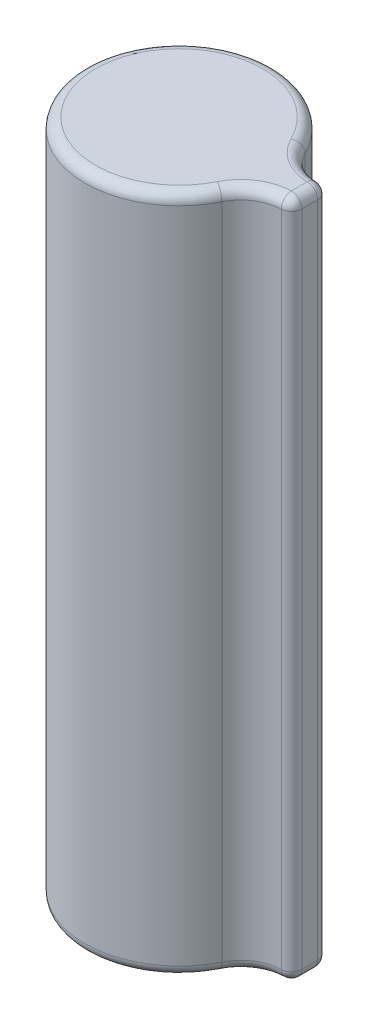
ISO-10303-21;
HEADER;
FILE_DESCRIPTION(('STEP AP214'),'2;1');
FILE_NAME('part.step','',(''),(''),'','','');
FILE_SCHEMA(('AUTOMOTIVE_DESIGN { 1 0 10303 214 1 1 1 1 }'));
ENDSEC;
DATA;
#1=APPLICATION_CONTEXT('core data for automotive mechanical design processes');
#2=APPLICATION_PROTOCOL_DEFINITION('international standard','automotive_design',2000,#1);
#3=PRODUCT_CONTEXT('',#1,'mechanical');
#4=PRODUCT('Part','Part','',(#3));
#5=PRODUCT_RELATED_PRODUCT_CATEGORY('part','',(#4));
#6=PRODUCT_DEFINITION_FORMATION('','',#4);
#7=PRODUCT_DEFINITION_CONTEXT('part definition',#1,'design');
#8=PRODUCT_DEFINITION('design','',#6,#7);
#9=PRODUCT_DEFINITION_SHAPE('','',#8);
#10=(LENGTH_UNIT() NAMED_UNIT(*) SI_UNIT(.MILLI.,.METRE.));
#11=(NAMED_UNIT(*) PLANE_ANGLE_UNIT() SI_UNIT($,.RADIAN.));
#12=(NAMED_UNIT(*) SI_UNIT($,.STERADIAN.) SOLID_ANGLE_UNIT());
#13=UNCERTAINTY_MEASURE_WITH_UNIT(LENGTH_MEASURE(1.E-05),#10,'distance_accuracy_value','');
#14=(GEOMETRIC_REPRESENTATION_CONTEXT(3) GLOBAL_UNCERTAINTY_ASSIGNED_CONTEXT((#13)) GLOBAL_UNIT_ASSIGNED_CONTEXT((#10,
#11,#12)) REPRESENTATION_CONTEXT('',''));
#15=CARTESIAN_POINT('',(0.,0.,0.));
#16=DIRECTION('',(0.,0.,1.));
#17=DIRECTION('',(1.,0.,0.));
#18=AXIS2_PLACEMENT_3D('',#15,#16,#17);
#19=CARTESIAN_POINT('',(0.,65.,0.));
#20=DIRECTION('',(0.,-1.,0.));
#21=DIRECTION('',(0.,0.,-1.));
#22=AXIS2_PLACEMENT_3D('',#19,#20,#21);
#23=CYLINDRICAL_SURFACE('',#22,9.);
#24=DIRECTION('',(0.,-1.,0.));
#25=VECTOR('',#24,1.);
#26=CARTESIAN_POINT('',(8.07177033440378,65.,-3.98076923076923));
#27=LINE('',#26,#25);
#28=CARTESIAN_POINT('',(8.07177033440378,64.,-3.98076923076923));
#29=VERTEX_POINT('',#28);
#30=CARTESIAN_POINT('',(8.07177033440378,1.,-3.98076923076923));
#31=VERTEX_POINT('',#30);
#32=EDGE_CURVE('E144',#29,#31,#27,.T.);
#33=ORIENTED_EDGE('',*,*,#32,.T.);
#34=CARTESIAN_POINT('',(0.,1.,0.));
#35=DIRECTION('',(0.,1.,0.));
#36=DIRECTION('',(0.,0.,1.));
#37=AXIS2_PLACEMENT_3D('',#34,#35,#36);
#38=CIRCLE('',#37,9.);
#39=CARTESIAN_POINT('',(8.07177033440378,1.,3.98076923076923));
#40=VERTEX_POINT('',#39);
#41=EDGE_CURVE('E217',#31,#40,#38,.T.);
#42=ORIENTED_EDGE('',*,*,#41,.T.);
#43=DIRECTION('',(0.,-1.,0.));
#44=VECTOR('',#43,1.);
#45=CARTESIAN_POINT('',(8.07177033440378,65.,3.98076923076923));
#46=LINE('',#45,#44);
#47=CARTESIAN_POINT('',(8.07177033440378,64.,3.98076923076923));
#48=VERTEX_POINT('',#47);
#49=EDGE_CURVE('E182',#40,#48,#46,.F.);
#50=ORIENTED_EDGE('',*,*,#49,.T.);
#51=CARTESIAN_POINT('',(0.,64.,0.));
#52=DIRECTION('',(0.,1.,0.));
#53=DIRECTION('',(0.,0.,1.));
#54=AXIS2_PLACEMENT_3D('',#51,#52,#53);
#55=CIRCLE('',#54,9.);
#56=EDGE_CURVE('E222',#48,#29,#55,.F.);
#57=ORIENTED_EDGE('',*,*,#56,.T.);
#58=EDGE_LOOP('',(#33,#42,#50,#57));
#59=FACE_BOUND('',#58,.T.);
#60=ADVANCED_FACE('F40',(#59),#23,.T.);
#61=CARTESIAN_POINT('',(12.5,65.,0.));
#62=DIRECTION('',(1.,0.,0.));
#63=DIRECTION('',(0.,0.,-1.));
#64=AXIS2_PLACEMENT_3D('',#61,#62,#63);
#65=PLANE('',#64);
#66=DIRECTION('',(0.,1.,0.));
#67=VECTOR('',#66,1.);
#68=CARTESIAN_POINT('',(12.5,0.,0.752535865431005));
#69=LINE('',#68,#67);
#70=CARTESIAN_POINT('',(12.5,64.,0.752535865431005));
#71=VERTEX_POINT('',#70);
#72=CARTESIAN_POINT('',(12.5,1.,0.752535865431005));
#73=VERTEX_POINT('',#72);
#74=EDGE_CURVE('E125',#71,#73,#69,.F.);
#75=ORIENTED_EDGE('',*,*,#74,.T.);
#76=DIRECTION('',(0.,0.,1.));
#77=VECTOR('',#76,1.);
#78=CARTESIAN_POINT('',(12.5,1.,-0.752535865431005));
#79=LINE('',#78,#77);
#80=CARTESIAN_POINT('',(12.5,1.,-0.752535865431005));
#81=VERTEX_POINT('',#80);
#82=EDGE_CURVE('E119',#73,#81,#79,.F.);
#83=ORIENTED_EDGE('',*,*,#82,.T.);
#84=DIRECTION('',(0.,1.,0.));
#85=VECTOR('',#84,1.);
#86=CARTESIAN_POINT('',(12.5,65.,-0.752535865431005));
#87=LINE('',#86,#85);
#88=CARTESIAN_POINT('',(12.5,64.,-0.752535865431005));
#89=VERTEX_POINT('',#88);
#90=EDGE_CURVE('E122',#81,#89,#87,.T.);
#91=ORIENTED_EDGE('',*,*,#90,.T.);
#92=DIRECTION('',(0.,0.,1.));
#93=VECTOR('',#92,1.);
#94=CARTESIAN_POINT('',(12.5,64.,0.));
#95=LINE('',#94,#93);
#96=EDGE_CURVE('E132',#89,#71,#95,.T.);
#97=ORIENTED_EDGE('',*,*,#96,.T.);
#98=EDGE_LOOP('',(#75,#83,#91,#97));
#99=FACE_BOUND('',#98,.T.);
#100=ADVANCED_FACE('F121',(#99),#65,.T.);
#101=CARTESIAN_POINT('',(0.,65.,0.));
#102=DIRECTION('',(0.,1.,0.));
#103=DIRECTION('',(0.,0.,1.));
#104=AXIS2_PLACEMENT_3D('',#101,#102,#103);
#105=PLANE('',#104);
#106=CARTESIAN_POINT('',(11.659223816361,65.,-5.75));
#107=DIRECTION('',(0.,1.,0.));
#108=DIRECTION('',(0.,0.,1.));
#109=AXIS2_PLACEMENT_3D('',#106,#107,#108);
#110=CIRCLE('',#109,5.);
#111=CARTESIAN_POINT('',(11.5,65.,-0.752535865431005));
#112=VERTEX_POINT('',#111);
#113=CARTESIAN_POINT('',(7.17490696391447,65.,-3.53846153846154));
#114=VERTEX_POINT('',#113);
#115=EDGE_CURVE('E50',#112,#114,#110,.F.);
#116=ORIENTED_EDGE('',*,*,#115,.T.);
#117=CARTESIAN_POINT('',(0.,65.,0.));
#118=DIRECTION('',(0.,1.,0.));
#119=DIRECTION('',(0.,0.,1.));
#120=AXIS2_PLACEMENT_3D('',#117,#118,#119);
#121=CIRCLE('',#120,8.);
#122=CARTESIAN_POINT('',(7.17490696391447,65.,3.53846153846154));
#123=VERTEX_POINT('',#122);
#124=EDGE_CURVE('E11',#114,#123,#121,.T.);
#125=ORIENTED_EDGE('',*,*,#124,.T.);
#126=CARTESIAN_POINT('',(11.659223816361,65.,5.75));
#127=DIRECTION('',(0.,1.,0.));
#128=DIRECTION('',(0.,0.,1.));
#129=AXIS2_PLACEMENT_3D('',#126,#127,#128);
#130=CIRCLE('',#129,5.);
#131=CARTESIAN_POINT('',(11.5,65.,0.752535865431005));
#132=VERTEX_POINT('',#131);
#133=EDGE_CURVE('E131',#123,#132,#130,.F.);
#134=ORIENTED_EDGE('',*,*,#133,.T.);
#135=DIRECTION('',(0.,0.,1.));
#136=VECTOR('',#135,1.);
#137=CARTESIAN_POINT('',(11.5,65.,0.));
#138=LINE('',#137,#136);
#139=EDGE_CURVE('E61',#132,#112,#138,.F.);
#140=ORIENTED_EDGE('',*,*,#139,.T.);
#141=EDGE_LOOP('',(#116,#125,#134,#140));
#142=FACE_BOUND('',#141,.T.);
#143=ADVANCED_FACE('F237',(#142),#105,.T.);
#144=CARTESIAN_POINT('',(0.,0.,0.));
#145=DIRECTION('',(0.,1.,0.));
#146=DIRECTION('',(0.,0.,1.));
#147=AXIS2_PLACEMENT_3D('',#144,#145,#146);
#148=PLANE('',#147);
#149=CARTESIAN_POINT('',(0.,0.,0.));
#150=DIRECTION('',(0.,1.,0.));
#151=DIRECTION('',(0.,0.,1.));
#152=AXIS2_PLACEMENT_3D('',#149,#150,#151);
#153=CIRCLE('',#152,8.);
#154=CARTESIAN_POINT('',(7.17490696391447,0.,3.53846153846154));
#155=VERTEX_POINT('',#154);
#156=CARTESIAN_POINT('',(7.17490696391447,0.,-3.53846153846154));
#157=VERTEX_POINT('',#156);
#158=EDGE_CURVE('E263',#155,#157,#153,.F.);
#159=ORIENTED_EDGE('',*,*,#158,.T.);
#160=CARTESIAN_POINT('',(11.659223816361,0.,-5.75));
#161=DIRECTION('',(0.,1.,0.));
#162=DIRECTION('',(0.,0.,1.));
#163=AXIS2_PLACEMENT_3D('',#160,#161,#162);
#164=CIRCLE('',#163,5.);
#165=CARTESIAN_POINT('',(11.5,0.,-0.752535865431005));
#166=VERTEX_POINT('',#165);
#167=EDGE_CURVE('E260',#157,#166,#164,.T.);
#168=ORIENTED_EDGE('',*,*,#167,.T.);
#169=DIRECTION('',(0.,0.,1.));
#170=VECTOR('',#169,1.);
#171=CARTESIAN_POINT('',(11.5,0.,0.752535865431005));
#172=LINE('',#171,#170);
#173=CARTESIAN_POINT('',(11.5,0.,0.752535865431005));
#174=VERTEX_POINT('',#173);
#175=EDGE_CURVE('E153',#166,#174,#172,.T.);
#176=ORIENTED_EDGE('',*,*,#175,.T.);
#177=CARTESIAN_POINT('',(11.659223816361,0.,5.75));
#178=DIRECTION('',(0.,1.,0.));
#179=DIRECTION('',(0.,0.,1.));
#180=AXIS2_PLACEMENT_3D('',#177,#178,#179);
#181=CIRCLE('',#180,5.);
#182=EDGE_CURVE('E266',#174,#155,#181,.T.);
#183=ORIENTED_EDGE('',*,*,#182,.T.);
#184=EDGE_LOOP('',(#159,#168,#176,#183));
#185=FACE_BOUND('',#184,.T.);
#186=ADVANCED_FACE('F300',(#185),#148,.F.);
#187=CARTESIAN_POINT('',(11.659223816361,65.,-5.75));
#188=DIRECTION('',(0.,-1.,0.));
#189=DIRECTION('',(0.,0.,-1.));
#190=AXIS2_PLACEMENT_3D('',#187,#188,#189);
#191=CYLINDRICAL_SURFACE('',#190,4.);
#192=DIRECTION('',(0.,-1.,0.));
#193=VECTOR('',#192,1.);
#194=CARTESIAN_POINT('',(11.5318447632722,65.,-1.7520286923448));
#195=LINE('',#194,#193);
#196=CARTESIAN_POINT('',(11.5318447632722,64.,-1.7520286923448));
#197=VERTEX_POINT('',#196);
#198=CARTESIAN_POINT('',(11.5318447632722,1.,-1.7520286923448));
#199=VERTEX_POINT('',#198);
#200=EDGE_CURVE('E273',#197,#199,#195,.T.);
#201=ORIENTED_EDGE('',*,*,#200,.T.);
#202=CARTESIAN_POINT('',(11.659223816361,1.,-5.75));
#203=DIRECTION('',(0.,1.,0.));
#204=DIRECTION('',(0.,0.,1.));
#205=AXIS2_PLACEMENT_3D('',#202,#203,#204);
#206=CIRCLE('',#205,4.);
#207=EDGE_CURVE('E254',#199,#31,#206,.F.);
#208=ORIENTED_EDGE('',*,*,#207,.T.);
#209=ORIENTED_EDGE('',*,*,#32,.F.);
#210=CARTESIAN_POINT('',(11.659223816361,64.,-5.75));
#211=DIRECTION('',(0.,1.,0.));
#212=DIRECTION('',(0.,0.,1.));
#213=AXIS2_PLACEMENT_3D('',#210,#211,#212);
#214=CIRCLE('',#213,4.);
#215=EDGE_CURVE('E245',#29,#197,#214,.T.);
#216=ORIENTED_EDGE('',*,*,#215,.T.);
#217=EDGE_LOOP('',(#201,#208,#209,#216));
#218=FACE_BOUND('',#217,.T.);
#219=ADVANCED_FACE('F312',(#218),#191,.F.);
#220=CARTESIAN_POINT('',(11.659223816361,65.,5.75));
#221=DIRECTION('',(0.,-1.,0.));
#222=DIRECTION('',(0.,0.,-1.));
#223=AXIS2_PLACEMENT_3D('',#220,#221,#222);
#224=CYLINDRICAL_SURFACE('',#223,4.);
#225=ORIENTED_EDGE('',*,*,#49,.F.);
#226=CARTESIAN_POINT('',(11.659223816361,1.,5.75));
#227=DIRECTION('',(0.,1.,0.));
#228=DIRECTION('',(0.,0.,1.));
#229=AXIS2_PLACEMENT_3D('',#226,#227,#228);
#230=CIRCLE('',#229,4.);
#231=CARTESIAN_POINT('',(11.5318447632722,1.,1.7520286923448));
#232=VERTEX_POINT('',#231);
#233=EDGE_CURVE('E216',#40,#232,#230,.F.);
#234=ORIENTED_EDGE('',*,*,#233,.T.);
#235=DIRECTION('',(0.,-1.,0.));
#236=VECTOR('',#235,1.);
#237=CARTESIAN_POINT('',(11.5318447632722,65.,1.7520286923448));
#238=LINE('',#237,#236);
#239=CARTESIAN_POINT('',(11.5318447632722,64.,1.7520286923448));
#240=VERTEX_POINT('',#239);
#241=EDGE_CURVE('E276',#232,#240,#238,.F.);
#242=ORIENTED_EDGE('',*,*,#241,.T.);
#243=CARTESIAN_POINT('',(11.659223816361,64.,5.75));
#244=DIRECTION('',(0.,1.,0.));
#245=DIRECTION('',(0.,0.,1.));
#246=AXIS2_PLACEMENT_3D('',#243,#244,#245);
#247=CIRCLE('',#246,4.);
#248=EDGE_CURVE('E210',#240,#48,#247,.T.);
#249=ORIENTED_EDGE('',*,*,#248,.T.);
#250=EDGE_LOOP('',(#225,#234,#242,#249));
#251=FACE_BOUND('',#250,.T.);
#252=ADVANCED_FACE('F286',(#251),#224,.F.);
#253=CARTESIAN_POINT('',(11.5,65.,0.752535865431005));
#254=DIRECTION('',(0.,-1.,0.));
#255=DIRECTION('',(0.,0.,-1.));
#256=AXIS2_PLACEMENT_3D('',#253,#254,#255);
#257=CYLINDRICAL_SURFACE('',#256,1.);
#258=ORIENTED_EDGE('',*,*,#241,.F.);
#259=CARTESIAN_POINT('',(11.5,1.,0.752535865431005));
#260=DIRECTION('',(0.,-1.,0.));
#261=DIRECTION('',(0.,0.,-1.));
#262=AXIS2_PLACEMENT_3D('',#259,#260,#261);
#263=CIRCLE('',#262,1.);
#264=EDGE_CURVE('E228',#232,#73,#263,.F.);
#265=ORIENTED_EDGE('',*,*,#264,.T.);
#266=ORIENTED_EDGE('',*,*,#74,.F.);
#267=CARTESIAN_POINT('',(11.5,64.,0.752535865431005));
#268=DIRECTION('',(0.,-1.,0.));
#269=DIRECTION('',(0.,0.,-1.));
#270=AXIS2_PLACEMENT_3D('',#267,#268,#269);
#271=CIRCLE('',#270,1.);
#272=EDGE_CURVE('E204',#71,#240,#271,.T.);
#273=ORIENTED_EDGE('',*,*,#272,.T.);
#274=EDGE_LOOP('',(#258,#265,#266,#273));
#275=FACE_BOUND('',#274,.T.);
#276=ADVANCED_FACE('F304',(#275),#257,.T.);
#277=CARTESIAN_POINT('',(11.5,65.,-0.752535865431005));
#278=DIRECTION('',(0.,-1.,0.));
#279=DIRECTION('',(0.,0.,-1.));
#280=AXIS2_PLACEMENT_3D('',#277,#278,#279);
#281=CYLINDRICAL_SURFACE('',#280,1.);
#282=ORIENTED_EDGE('',*,*,#90,.F.);
#283=CARTESIAN_POINT('',(11.5,1.,-0.752535865431005));
#284=DIRECTION('',(0.,-1.,0.));
#285=DIRECTION('',(0.,0.,-1.));
#286=AXIS2_PLACEMENT_3D('',#283,#284,#285);
#287=CIRCLE('',#286,1.);
#288=EDGE_CURVE('E139',#81,#199,#287,.F.);
#289=ORIENTED_EDGE('',*,*,#288,.T.);
#290=ORIENTED_EDGE('',*,*,#200,.F.);
#291=CARTESIAN_POINT('',(11.5,64.,-0.752535865431005));
#292=DIRECTION('',(0.,-1.,0.));
#293=DIRECTION('',(0.,0.,-1.));
#294=AXIS2_PLACEMENT_3D('',#291,#292,#293);
#295=CIRCLE('',#294,1.);
#296=EDGE_CURVE('E142',#197,#89,#295,.T.);
#297=ORIENTED_EDGE('',*,*,#296,.T.);
#298=EDGE_LOOP('',(#282,#289,#290,#297));
#299=FACE_BOUND('',#298,.T.);
#300=ADVANCED_FACE('F137',(#299),#281,.T.);
#301=CARTESIAN_POINT('',(11.659223816361,1.,5.75));
#302=DIRECTION('',(0.,1.,0.));
#303=DIRECTION('',(0.,0.,1.));
#304=AXIS2_PLACEMENT_3D('',#301,#302,#303);
#305=TOROIDAL_SURFACE('',#304,5.,1.);
#306=CARTESIAN_POINT('',(11.5,1.,0.752535865431005));
#307=DIRECTION('',(0.999492826913799,0.,-0.0318447632722037));
#308=DIRECTION('',(-0.0318447632722037,0.,-0.999492826913799));
#309=AXIS2_PLACEMENT_3D('',#306,#307,#308);
#310=CIRCLE('',#309,1.);
#311=EDGE_CURVE('E174',#232,#174,#310,.T.);
#312=ORIENTED_EDGE('',*,*,#311,.F.);
#313=ORIENTED_EDGE('',*,*,#233,.F.);
#314=CARTESIAN_POINT('',(7.17490696391447,1.,3.53846153846154));
#315=DIRECTION('',(-0.442307692307692,0.,0.896863370489309));
#316=DIRECTION('',(0.896863370489309,0.,0.442307692307692));
#317=AXIS2_PLACEMENT_3D('',#314,#315,#316);
#318=CIRCLE('',#317,1.);
#319=EDGE_CURVE('E178',#155,#40,#318,.T.);
#320=ORIENTED_EDGE('',*,*,#319,.F.);
#321=ORIENTED_EDGE('',*,*,#182,.F.);
#322=EDGE_LOOP('',(#312,#313,#320,#321));
#323=FACE_BOUND('',#322,.T.);
#324=ADVANCED_FACE('F291',(#323),#305,.T.);
#325=CARTESIAN_POINT('',(0.,1.,0.));
#326=DIRECTION('',(0.,1.,0.));
#327=DIRECTION('',(0.,0.,1.));
#328=AXIS2_PLACEMENT_3D('',#325,#326,#327);
#329=TOROIDAL_SURFACE('',#328,8.,1.);
#330=ORIENTED_EDGE('',*,*,#319,.T.);
#331=ORIENTED_EDGE('',*,*,#41,.F.);
#332=CARTESIAN_POINT('',(7.17490696391447,1.,-3.53846153846154));
#333=DIRECTION('',(0.442307692307692,0.,0.896863370489309));
#334=DIRECTION('',(0.896863370489309,0.,-0.442307692307692));
#335=AXIS2_PLACEMENT_3D('',#332,#333,#334);
#336=CIRCLE('',#335,1.);
#337=EDGE_CURVE('E170',#157,#31,#336,.T.);
#338=ORIENTED_EDGE('',*,*,#337,.F.);
#339=ORIENTED_EDGE('',*,*,#158,.F.);
#340=EDGE_LOOP('',(#330,#331,#338,#339));
#341=FACE_BOUND('',#340,.T.);
#342=ADVANCED_FACE('F296',(#341),#329,.T.);
#343=CARTESIAN_POINT('',(11.5,1.,0.752535865431005));
#344=DIRECTION('',(0.,1.,0.));
#345=DIRECTION('',(0.,0.,1.));
#346=AXIS2_PLACEMENT_3D('',#343,#344,#345);
#347=SPHERICAL_SURFACE('',#346,1.);
#348=ORIENTED_EDGE('',*,*,#264,.F.);
#349=ORIENTED_EDGE('',*,*,#311,.T.);
#350=CARTESIAN_POINT('',(11.5,1.,0.752535865431005));
#351=DIRECTION('',(0.,0.,-1.));
#352=DIRECTION('',(-1.,0.,0.));
#353=AXIS2_PLACEMENT_3D('',#350,#351,#352);
#354=CIRCLE('',#353,1.);
#355=EDGE_CURVE('E162',#73,#174,#354,.T.);
#356=ORIENTED_EDGE('',*,*,#355,.F.);
#357=EDGE_LOOP('',(#348,#349,#356));
#358=FACE_BOUND('',#357,.T.);
#359=ADVANCED_FACE('F302',(#358),#347,.T.);
#360=CARTESIAN_POINT('',(11.659223816361,1.,-5.75));
#361=DIRECTION('',(0.,1.,0.));
#362=DIRECTION('',(0.,0.,1.));
#363=AXIS2_PLACEMENT_3D('',#360,#361,#362);
#364=TOROIDAL_SURFACE('',#363,5.,1.);
#365=ORIENTED_EDGE('',*,*,#337,.T.);
#366=ORIENTED_EDGE('',*,*,#207,.F.);
#367=CARTESIAN_POINT('',(11.5,1.,-0.752535865431005));
#368=DIRECTION('',(0.999492826913799,0.,0.0318447632722037));
#369=DIRECTION('',(0.0318447632722037,0.,-0.999492826913799));
#370=AXIS2_PLACEMENT_3D('',#367,#368,#369);
#371=CIRCLE('',#370,1.);
#372=EDGE_CURVE('E150',#166,#199,#371,.T.);
#373=ORIENTED_EDGE('',*,*,#372,.F.);
#374=ORIENTED_EDGE('',*,*,#167,.F.);
#375=EDGE_LOOP('',(#365,#366,#373,#374));
#376=FACE_BOUND('',#375,.T.);
#377=ADVANCED_FACE('F328',(#376),#364,.T.);
#378=CARTESIAN_POINT('',(11.5,1.,0.));
#379=DIRECTION('',(0.,0.,-1.));
#380=DIRECTION('',(-1.,0.,0.));
#381=AXIS2_PLACEMENT_3D('',#378,#379,#380);
#382=CYLINDRICAL_SURFACE('',#381,1.);
#383=ORIENTED_EDGE('',*,*,#355,.T.);
#384=ORIENTED_EDGE('',*,*,#175,.F.);
#385=CARTESIAN_POINT('',(11.5,1.,-0.752535865431005));
#386=DIRECTION('',(0.,0.,-1.));
#387=DIRECTION('',(-1.,0.,0.));
#388=AXIS2_PLACEMENT_3D('',#385,#386,#387);
#389=CIRCLE('',#388,1.);
#390=EDGE_CURVE('E148',#81,#166,#389,.T.);
#391=ORIENTED_EDGE('',*,*,#390,.F.);
#392=ORIENTED_EDGE('',*,*,#82,.F.);
#393=EDGE_LOOP('',(#383,#384,#391,#392));
#394=FACE_BOUND('',#393,.T.);
#395=ADVANCED_FACE('F156',(#394),#382,.T.);
#396=CARTESIAN_POINT('',(11.5,1.,-0.752535865431005));
#397=DIRECTION('',(0.,1.,0.));
#398=DIRECTION('',(0.,0.,1.));
#399=AXIS2_PLACEMENT_3D('',#396,#397,#398);
#400=SPHERICAL_SURFACE('',#399,1.);
#401=ORIENTED_EDGE('',*,*,#372,.T.);
#402=ORIENTED_EDGE('',*,*,#288,.F.);
#403=ORIENTED_EDGE('',*,*,#390,.T.);
#404=EDGE_LOOP('',(#401,#402,#403));
#405=FACE_BOUND('',#404,.T.);
#406=ADVANCED_FACE('F147',(#405),#400,.T.);
#407=CARTESIAN_POINT('',(11.5,64.,0.));
#408=DIRECTION('',(0.,0.,1.));
#409=DIRECTION('',(1.,0.,0.));
#410=AXIS2_PLACEMENT_3D('',#407,#408,#409);
#411=CYLINDRICAL_SURFACE('',#410,1.);
#412=CARTESIAN_POINT('',(11.5,64.,0.752535865431005));
#413=DIRECTION('',(0.,0.,1.));
#414=DIRECTION('',(1.,0.,0.));
#415=AXIS2_PLACEMENT_3D('',#412,#413,#414);
#416=CIRCLE('',#415,1.);
#417=EDGE_CURVE('E165',#71,#132,#416,.T.);
#418=ORIENTED_EDGE('',*,*,#417,.F.);
#419=ORIENTED_EDGE('',*,*,#96,.F.);
#420=CARTESIAN_POINT('',(11.5,64.,-0.752535865431005));
#421=DIRECTION('',(0.,0.,-1.));
#422=DIRECTION('',(-1.,0.,0.));
#423=AXIS2_PLACEMENT_3D('',#420,#421,#422);
#424=CIRCLE('',#423,1.);
#425=EDGE_CURVE('E44',#112,#89,#424,.T.);
#426=ORIENTED_EDGE('',*,*,#425,.F.);
#427=ORIENTED_EDGE('',*,*,#139,.F.);
#428=EDGE_LOOP('',(#418,#419,#426,#427));
#429=FACE_BOUND('',#428,.T.);
#430=ADVANCED_FACE('F42',(#429),#411,.T.);
#431=CARTESIAN_POINT('',(11.5,64.,-0.752535865431005));
#432=DIRECTION('',(0.,1.,0.));
#433=DIRECTION('',(0.,0.,1.));
#434=AXIS2_PLACEMENT_3D('',#431,#432,#433);
#435=SPHERICAL_SURFACE('',#434,1.);
#436=ORIENTED_EDGE('',*,*,#425,.T.);
#437=ORIENTED_EDGE('',*,*,#296,.F.);
#438=CARTESIAN_POINT('',(11.5,64.,-0.752535865431005));
#439=DIRECTION('',(-0.999492826913799,0.,-0.0318447632722037));
#440=DIRECTION('',(-0.0318447632722037,0.,0.999492826913799));
#441=AXIS2_PLACEMENT_3D('',#438,#439,#440);
#442=CIRCLE('',#441,1.);
#443=EDGE_CURVE('E193',#112,#197,#442,.T.);
#444=ORIENTED_EDGE('',*,*,#443,.F.);
#445=EDGE_LOOP('',(#436,#437,#444));
#446=FACE_BOUND('',#445,.T.);
#447=ADVANCED_FACE('F241',(#446),#435,.T.);
#448=CARTESIAN_POINT('',(11.5,64.,0.752535865431005));
#449=DIRECTION('',(0.,1.,0.));
#450=DIRECTION('',(0.,0.,1.));
#451=AXIS2_PLACEMENT_3D('',#448,#449,#450);
#452=SPHERICAL_SURFACE('',#451,1.);
#453=ORIENTED_EDGE('',*,*,#272,.F.);
#454=ORIENTED_EDGE('',*,*,#417,.T.);
#455=CARTESIAN_POINT('',(11.5,64.,0.752535865431005));
#456=DIRECTION('',(-0.999492826913799,0.,0.0318447632722037));
#457=DIRECTION('',(0.0318447632722037,0.,0.999492826913799));
#458=AXIS2_PLACEMENT_3D('',#455,#456,#457);
#459=CIRCLE('',#458,1.);
#460=EDGE_CURVE('E189',#240,#132,#459,.T.);
#461=ORIENTED_EDGE('',*,*,#460,.F.);
#462=EDGE_LOOP('',(#453,#454,#461));
#463=FACE_BOUND('',#462,.T.);
#464=ADVANCED_FACE('F202',(#463),#452,.T.);
#465=CARTESIAN_POINT('',(11.659223816361,64.,-5.75));
#466=DIRECTION('',(0.,1.,0.));
#467=DIRECTION('',(0.,0.,1.));
#468=AXIS2_PLACEMENT_3D('',#465,#466,#467);
#469=TOROIDAL_SURFACE('',#468,5.,1.);
#470=ORIENTED_EDGE('',*,*,#443,.T.);
#471=ORIENTED_EDGE('',*,*,#215,.F.);
#472=CARTESIAN_POINT('',(7.17490696391447,64.,-3.53846153846154));
#473=DIRECTION('',(-0.442307692307692,0.,-0.896863370489309));
#474=DIRECTION('',(-0.896863370489309,0.,0.442307692307693));
#475=AXIS2_PLACEMENT_3D('',#472,#473,#474);
#476=CIRCLE('',#475,1.);
#477=EDGE_CURVE('E186',#114,#29,#476,.T.);
#478=ORIENTED_EDGE('',*,*,#477,.F.);
#479=ORIENTED_EDGE('',*,*,#115,.F.);
#480=EDGE_LOOP('',(#470,#471,#478,#479));
#481=FACE_BOUND('',#480,.T.);
#482=ADVANCED_FACE('F244',(#481),#469,.T.);
#483=CARTESIAN_POINT('',(11.659223816361,64.,5.75));
#484=DIRECTION('',(0.,1.,0.));
#485=DIRECTION('',(0.,0.,1.));
#486=AXIS2_PLACEMENT_3D('',#483,#484,#485);
#487=TOROIDAL_SURFACE('',#486,5.,1.);
#488=ORIENTED_EDGE('',*,*,#460,.T.);
#489=ORIENTED_EDGE('',*,*,#133,.F.);
#490=CARTESIAN_POINT('',(7.17490696391447,64.,3.53846153846154));
#491=DIRECTION('',(-0.442307692307692,0.,0.896863370489309));
#492=DIRECTION('',(0.896863370489309,0.,0.442307692307693));
#493=AXIS2_PLACEMENT_3D('',#490,#491,#492);
#494=CIRCLE('',#493,1.);
#495=EDGE_CURVE('E183',#48,#123,#494,.T.);
#496=ORIENTED_EDGE('',*,*,#495,.F.);
#497=ORIENTED_EDGE('',*,*,#248,.F.);
#498=EDGE_LOOP('',(#488,#489,#496,#497));
#499=FACE_BOUND('',#498,.T.);
#500=ADVANCED_FACE('F208',(#499),#487,.T.);
#501=CARTESIAN_POINT('',(0.,64.,0.));
#502=DIRECTION('',(0.,1.,0.));
#503=DIRECTION('',(0.,0.,1.));
#504=AXIS2_PLACEMENT_3D('',#501,#502,#503);
#505=TOROIDAL_SURFACE('',#504,8.,1.);
#506=ORIENTED_EDGE('',*,*,#477,.T.);
#507=ORIENTED_EDGE('',*,*,#56,.F.);
#508=ORIENTED_EDGE('',*,*,#495,.T.);
#509=ORIENTED_EDGE('',*,*,#124,.F.);
#510=EDGE_LOOP('',(#506,#507,#508,#509));
#511=FACE_BOUND('',#510,.T.);
#512=ADVANCED_FACE('F249',(#511),#505,.T.);
#513=CLOSED_SHELL('',(#60,#100,#143,#186,#219,#252,#276,#300,#324,#342,#359,#377,#395,#406,#430,
#447,#464,#482,#500,#512));
#514=MANIFOLD_SOLID_BREP('B2',#513);
#515=ADVANCED_BREP_SHAPE_REPRESENTATION('',(#18,#514),#14);
#516=SHAPE_DEFINITION_REPRESENTATION(#9,#515);
ENDSEC;
END-ISO-10303-21;
